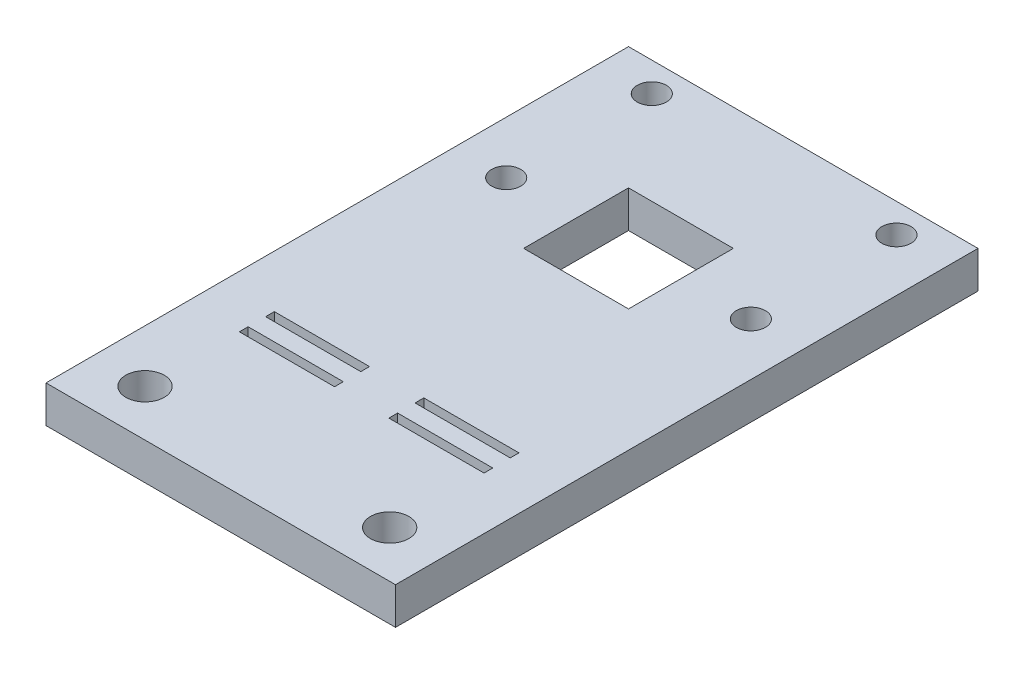
ISO-10303-21;
HEADER;
FILE_DESCRIPTION(('STEP AP214'),'2;1');
FILE_NAME('part.step','',(''),(''),'','','');
FILE_SCHEMA(('AUTOMOTIVE_DESIGN { 1 0 10303 214 1 1 1 1 }'));
ENDSEC;
DATA;
#1=APPLICATION_CONTEXT('core data for automotive mechanical design processes');
#2=APPLICATION_PROTOCOL_DEFINITION('international standard','automotive_design',2000,#1);
#3=PRODUCT_CONTEXT('',#1,'mechanical');
#4=PRODUCT('Part','Part','',(#3));
#5=PRODUCT_RELATED_PRODUCT_CATEGORY('part','',(#4));
#6=PRODUCT_DEFINITION_FORMATION('','',#4);
#7=PRODUCT_DEFINITION_CONTEXT('part definition',#1,'design');
#8=PRODUCT_DEFINITION('design','',#6,#7);
#9=PRODUCT_DEFINITION_SHAPE('','',#8);
#10=(LENGTH_UNIT() NAMED_UNIT(*) SI_UNIT(.MILLI.,.METRE.));
#11=(NAMED_UNIT(*) PLANE_ANGLE_UNIT() SI_UNIT($,.RADIAN.));
#12=(NAMED_UNIT(*) SI_UNIT($,.STERADIAN.) SOLID_ANGLE_UNIT());
#13=UNCERTAINTY_MEASURE_WITH_UNIT(LENGTH_MEASURE(1.E-05),#10,'distance_accuracy_value','');
#14=(GEOMETRIC_REPRESENTATION_CONTEXT(3) GLOBAL_UNCERTAINTY_ASSIGNED_CONTEXT((#13)) GLOBAL_UNIT_ASSIGNED_CONTEXT((#10,
#11,#12)) REPRESENTATION_CONTEXT('',''));
#15=CARTESIAN_POINT('',(0.,0.,0.));
#16=DIRECTION('',(0.,0.,1.));
#17=DIRECTION('',(1.,0.,0.));
#18=AXIS2_PLACEMENT_3D('',#15,#16,#17);
#19=CARTESIAN_POINT('',(10.5,3.175,0.));
#20=DIRECTION('',(-1.,0.,0.));
#21=DIRECTION('',(0.,0.,1.));
#22=AXIS2_PLACEMENT_3D('',#19,#20,#21);
#23=PLANE('',#22);
#24=DIRECTION('',(0.,0.,-1.));
#25=VECTOR('',#24,1.);
#26=CARTESIAN_POINT('',(10.5,0.,0.));
#27=LINE('',#26,#25);
#28=CARTESIAN_POINT('',(10.5,0.,12.9005122492005));
#29=VERTEX_POINT('',#28);
#30=CARTESIAN_POINT('',(10.5,0.,12.1505122492005));
#31=VERTEX_POINT('',#30);
#32=EDGE_CURVE('E359',#29,#31,#27,.T.);
#33=ORIENTED_EDGE('',*,*,#32,.F.);
#34=DIRECTION('',(0.,-1.,0.));
#35=VECTOR('',#34,1.);
#36=CARTESIAN_POINT('',(10.5,3.175,12.9005122492005));
#37=LINE('',#36,#35);
#38=CARTESIAN_POINT('',(10.5,3.175,12.9005122492005));
#39=VERTEX_POINT('',#38);
#40=EDGE_CURVE('E11',#39,#29,#37,.T.);
#41=ORIENTED_EDGE('',*,*,#40,.F.);
#42=DIRECTION('',(0.,0.,-1.));
#43=VECTOR('',#42,1.);
#44=CARTESIAN_POINT('',(10.5,3.175,0.));
#45=LINE('',#44,#43);
#46=CARTESIAN_POINT('',(10.5,3.175,12.1505122492005));
#47=VERTEX_POINT('',#46);
#48=EDGE_CURVE('E215',#39,#47,#45,.T.);
#49=ORIENTED_EDGE('',*,*,#48,.T.);
#50=DIRECTION('',(0.,-1.,0.));
#51=VECTOR('',#50,1.);
#52=CARTESIAN_POINT('',(10.5,3.175,12.1505122492005));
#53=LINE('',#52,#51);
#54=EDGE_CURVE('E53',#47,#31,#53,.T.);
#55=ORIENTED_EDGE('',*,*,#54,.T.);
#56=EDGE_LOOP('',(#33,#41,#49,#55));
#57=FACE_BOUND('',#56,.T.);
#58=ADVANCED_FACE('F34',(#57),#23,.T.);
#59=CARTESIAN_POINT('',(0.,3.175,12.9005122492005));
#60=DIRECTION('',(0.,0.,1.));
#61=DIRECTION('',(1.,0.,0.));
#62=AXIS2_PLACEMENT_3D('',#59,#60,#61);
#63=PLANE('',#62);
#64=DIRECTION('',(-1.,0.,0.));
#65=VECTOR('',#64,1.);
#66=CARTESIAN_POINT('',(0.,0.,12.9005122492005));
#67=LINE('',#66,#65);
#68=CARTESIAN_POINT('',(2.3300271835742,0.,12.9005122492005));
#69=VERTEX_POINT('',#68);
#70=EDGE_CURVE('E220',#29,#69,#67,.T.);
#71=ORIENTED_EDGE('',*,*,#70,.T.);
#72=DIRECTION('',(0.,-1.,0.));
#73=VECTOR('',#72,1.);
#74=CARTESIAN_POINT('',(2.3300271835742,3.175,12.9005122492005));
#75=LINE('',#74,#73);
#76=CARTESIAN_POINT('',(2.3300271835742,3.175,12.9005122492005));
#77=VERTEX_POINT('',#76);
#78=EDGE_CURVE('E44',#77,#69,#75,.T.);
#79=ORIENTED_EDGE('',*,*,#78,.F.);
#80=DIRECTION('',(-1.,0.,0.));
#81=VECTOR('',#80,1.);
#82=CARTESIAN_POINT('',(0.,3.175,12.9005122492005));
#83=LINE('',#82,#81);
#84=EDGE_CURVE('E210',#39,#77,#83,.T.);
#85=ORIENTED_EDGE('',*,*,#84,.F.);
#86=ORIENTED_EDGE('',*,*,#40,.T.);
#87=EDGE_LOOP('',(#71,#79,#85,#86));
#88=FACE_BOUND('',#87,.T.);
#89=ADVANCED_FACE('F218',(#88),#63,.F.);
#90=CARTESIAN_POINT('',(2.3300271835742,3.175,0.));
#91=DIRECTION('',(-1.,0.,0.));
#92=DIRECTION('',(0.,0.,1.));
#93=AXIS2_PLACEMENT_3D('',#90,#91,#92);
#94=PLANE('',#93);
#95=DIRECTION('',(0.,0.,-1.));
#96=VECTOR('',#95,1.);
#97=CARTESIAN_POINT('',(2.3300271835742,0.,0.));
#98=LINE('',#97,#96);
#99=CARTESIAN_POINT('',(2.3300271835742,0.,12.1505122492005));
#100=VERTEX_POINT('',#99);
#101=EDGE_CURVE('E362',#69,#100,#98,.T.);
#102=ORIENTED_EDGE('',*,*,#101,.T.);
#103=DIRECTION('',(0.,-1.,0.));
#104=VECTOR('',#103,1.);
#105=CARTESIAN_POINT('',(2.3300271835742,3.175,12.1505122492005));
#106=LINE('',#105,#104);
#107=CARTESIAN_POINT('',(2.3300271835742,3.175,12.1505122492005));
#108=VERTEX_POINT('',#107);
#109=EDGE_CURVE('E127',#108,#100,#106,.T.);
#110=ORIENTED_EDGE('',*,*,#109,.F.);
#111=DIRECTION('',(0.,0.,-1.));
#112=VECTOR('',#111,1.);
#113=CARTESIAN_POINT('',(2.3300271835742,3.175,0.));
#114=LINE('',#113,#112);
#115=EDGE_CURVE('E202',#77,#108,#114,.T.);
#116=ORIENTED_EDGE('',*,*,#115,.F.);
#117=ORIENTED_EDGE('',*,*,#78,.T.);
#118=EDGE_LOOP('',(#102,#110,#116,#117));
#119=FACE_BOUND('',#118,.T.);
#120=ADVANCED_FACE('F204',(#119),#94,.F.);
#121=CARTESIAN_POINT('',(10.5,3.175,0.));
#122=DIRECTION('',(-1.,0.,0.));
#123=DIRECTION('',(0.,0.,1.));
#124=AXIS2_PLACEMENT_3D('',#121,#122,#123);
#125=PLANE('',#124);
#126=DIRECTION('',(0.,0.,-1.));
#127=VECTOR('',#126,1.);
#128=CARTESIAN_POINT('',(10.5,0.,0.));
#129=LINE('',#128,#127);
#130=CARTESIAN_POINT('',(10.5,0.,10.6505122492005));
#131=VERTEX_POINT('',#130);
#132=CARTESIAN_POINT('',(10.5,0.,9.90051224920047));
#133=VERTEX_POINT('',#132);
#134=EDGE_CURVE('E347',#131,#133,#129,.T.);
#135=ORIENTED_EDGE('',*,*,#134,.F.);
#136=DIRECTION('',(0.,-1.,0.));
#137=VECTOR('',#136,1.);
#138=CARTESIAN_POINT('',(10.5,3.175,10.6505122492005));
#139=LINE('',#138,#137);
#140=CARTESIAN_POINT('',(10.5,3.175,10.6505122492005));
#141=VERTEX_POINT('',#140);
#142=EDGE_CURVE('E233',#141,#131,#139,.T.);
#143=ORIENTED_EDGE('',*,*,#142,.F.);
#144=DIRECTION('',(0.,0.,-1.));
#145=VECTOR('',#144,1.);
#146=CARTESIAN_POINT('',(10.5,3.175,0.));
#147=LINE('',#146,#145);
#148=CARTESIAN_POINT('',(10.5,3.175,9.90051224920047));
#149=VERTEX_POINT('',#148);
#150=EDGE_CURVE('E426',#141,#149,#147,.T.);
#151=ORIENTED_EDGE('',*,*,#150,.T.);
#152=DIRECTION('',(0.,-1.,0.));
#153=VECTOR('',#152,1.);
#154=CARTESIAN_POINT('',(10.5,3.175,9.90051224920047));
#155=LINE('',#154,#153);
#156=EDGE_CURVE('E225',#149,#133,#155,.T.);
#157=ORIENTED_EDGE('',*,*,#156,.T.);
#158=EDGE_LOOP('',(#135,#143,#151,#157));
#159=FACE_BOUND('',#158,.T.);
#160=ADVANCED_FACE('F473',(#159),#125,.T.);
#161=CARTESIAN_POINT('',(0.,3.175,10.6505122492005));
#162=DIRECTION('',(0.,0.,1.));
#163=DIRECTION('',(1.,0.,0.));
#164=AXIS2_PLACEMENT_3D('',#161,#162,#163);
#165=PLANE('',#164);
#166=DIRECTION('',(-1.,0.,0.));
#167=VECTOR('',#166,1.);
#168=CARTESIAN_POINT('',(0.,0.,10.6505122492005));
#169=LINE('',#168,#167);
#170=CARTESIAN_POINT('',(2.3300271835742,0.,10.6505122492005));
#171=VERTEX_POINT('',#170);
#172=EDGE_CURVE('E350',#131,#171,#169,.T.);
#173=ORIENTED_EDGE('',*,*,#172,.T.);
#174=DIRECTION('',(0.,-1.,0.));
#175=VECTOR('',#174,1.);
#176=CARTESIAN_POINT('',(2.3300271835742,3.175,10.6505122492005));
#177=LINE('',#176,#175);
#178=CARTESIAN_POINT('',(2.3300271835742,3.175,10.6505122492005));
#179=VERTEX_POINT('',#178);
#180=EDGE_CURVE('E230',#179,#171,#177,.T.);
#181=ORIENTED_EDGE('',*,*,#180,.F.);
#182=DIRECTION('',(-1.,0.,0.));
#183=VECTOR('',#182,1.);
#184=CARTESIAN_POINT('',(0.,3.175,10.6505122492005));
#185=LINE('',#184,#183);
#186=EDGE_CURVE('E429',#141,#179,#185,.T.);
#187=ORIENTED_EDGE('',*,*,#186,.F.);
#188=ORIENTED_EDGE('',*,*,#142,.T.);
#189=EDGE_LOOP('',(#173,#181,#187,#188));
#190=FACE_BOUND('',#189,.T.);
#191=ADVANCED_FACE('F469',(#190),#165,.F.);
#192=CARTESIAN_POINT('',(2.33002718357419,3.175,0.));
#193=DIRECTION('',(-1.,0.,0.));
#194=DIRECTION('',(0.,0.,1.));
#195=AXIS2_PLACEMENT_3D('',#192,#193,#194);
#196=PLANE('',#195);
#197=DIRECTION('',(0.,0.,-1.));
#198=VECTOR('',#197,1.);
#199=CARTESIAN_POINT('',(2.33002718357419,0.,0.));
#200=LINE('',#199,#198);
#201=CARTESIAN_POINT('',(2.3300271835742,0.,9.90051224920048));
#202=VERTEX_POINT('',#201);
#203=EDGE_CURVE('E353',#171,#202,#200,.T.);
#204=ORIENTED_EDGE('',*,*,#203,.T.);
#205=DIRECTION('',(0.,-1.,0.));
#206=VECTOR('',#205,1.);
#207=CARTESIAN_POINT('',(2.3300271835742,3.175,9.90051224920048));
#208=LINE('',#207,#206);
#209=CARTESIAN_POINT('',(2.3300271835742,3.175,9.90051224920048));
#210=VERTEX_POINT('',#209);
#211=EDGE_CURVE('E227',#210,#202,#208,.T.);
#212=ORIENTED_EDGE('',*,*,#211,.F.);
#213=DIRECTION('',(0.,0.,-1.));
#214=VECTOR('',#213,1.);
#215=CARTESIAN_POINT('',(2.33002718357419,3.175,0.));
#216=LINE('',#215,#214);
#217=EDGE_CURVE('E432',#179,#210,#216,.T.);
#218=ORIENTED_EDGE('',*,*,#217,.F.);
#219=ORIENTED_EDGE('',*,*,#180,.T.);
#220=EDGE_LOOP('',(#204,#212,#218,#219));
#221=FACE_BOUND('',#220,.T.);
#222=ADVANCED_FACE('F465',(#221),#196,.F.);
#223=CARTESIAN_POINT('',(15.0000000000001,3.175,0.));
#224=DIRECTION('',(1.,0.,0.));
#225=DIRECTION('',(0.,0.,-1.));
#226=AXIS2_PLACEMENT_3D('',#223,#224,#225);
#227=PLANE('',#226);
#228=DIRECTION('',(0.,0.,1.));
#229=VECTOR('',#228,1.);
#230=CARTESIAN_POINT('',(15.0000000000001,0.,0.));
#231=LINE('',#230,#229);
#232=CARTESIAN_POINT('',(15.0000000000001,0.,-25.));
#233=VERTEX_POINT('',#232);
#234=CARTESIAN_POINT('',(15.0000000000001,0.,25.));
#235=VERTEX_POINT('',#234);
#236=EDGE_CURVE('E335',#233,#235,#231,.T.);
#237=ORIENTED_EDGE('',*,*,#236,.F.);
#238=DIRECTION('',(0.,-1.,0.));
#239=VECTOR('',#238,1.);
#240=CARTESIAN_POINT('',(15.0000000000001,3.175,-25.));
#241=LINE('',#240,#239);
#242=CARTESIAN_POINT('',(15.0000000000001,3.175,-25.));
#243=VERTEX_POINT('',#242);
#244=EDGE_CURVE('E228',#243,#233,#241,.T.);
#245=ORIENTED_EDGE('',*,*,#244,.F.);
#246=DIRECTION('',(0.,0.,1.));
#247=VECTOR('',#246,1.);
#248=CARTESIAN_POINT('',(15.0000000000001,3.175,0.));
#249=LINE('',#248,#247);
#250=CARTESIAN_POINT('',(15.0000000000001,3.175,25.));
#251=VERTEX_POINT('',#250);
#252=EDGE_CURVE('E415',#243,#251,#249,.T.);
#253=ORIENTED_EDGE('',*,*,#252,.T.);
#254=DIRECTION('',(0.,-1.,0.));
#255=VECTOR('',#254,1.);
#256=CARTESIAN_POINT('',(15.0000000000001,3.175,25.));
#257=LINE('',#256,#255);
#258=EDGE_CURVE('E235',#251,#235,#257,.T.);
#259=ORIENTED_EDGE('',*,*,#258,.T.);
#260=EDGE_LOOP('',(#237,#245,#253,#259));
#261=FACE_BOUND('',#260,.T.);
#262=ADVANCED_FACE('F468',(#261),#227,.T.);
#263=CARTESIAN_POINT('',(0.,3.175,-25.));
#264=DIRECTION('',(0.,0.,-1.));
#265=DIRECTION('',(-1.,0.,0.));
#266=AXIS2_PLACEMENT_3D('',#263,#264,#265);
#267=PLANE('',#266);
#268=DIRECTION('',(1.,0.,0.));
#269=VECTOR('',#268,1.);
#270=CARTESIAN_POINT('',(0.,0.,-25.));
#271=LINE('',#270,#269);
#272=CARTESIAN_POINT('',(-15.0000000000001,0.,-25.));
#273=VERTEX_POINT('',#272);
#274=EDGE_CURVE('E338',#273,#233,#271,.T.);
#275=ORIENTED_EDGE('',*,*,#274,.F.);
#276=DIRECTION('',(0.,-1.,0.));
#277=VECTOR('',#276,1.);
#278=CARTESIAN_POINT('',(-15.0000000000001,3.175,-25.));
#279=LINE('',#278,#277);
#280=CARTESIAN_POINT('',(-15.0000000000001,3.175,-25.));
#281=VERTEX_POINT('',#280);
#282=EDGE_CURVE('E241',#281,#273,#279,.T.);
#283=ORIENTED_EDGE('',*,*,#282,.F.);
#284=DIRECTION('',(1.,0.,0.));
#285=VECTOR('',#284,1.);
#286=CARTESIAN_POINT('',(0.,3.175,-25.));
#287=LINE('',#286,#285);
#288=EDGE_CURVE('E418',#281,#243,#287,.T.);
#289=ORIENTED_EDGE('',*,*,#288,.T.);
#290=ORIENTED_EDGE('',*,*,#244,.T.);
#291=EDGE_LOOP('',(#275,#283,#289,#290));
#292=FACE_BOUND('',#291,.T.);
#293=ADVANCED_FACE('F486',(#292),#267,.T.);
#294=CARTESIAN_POINT('',(-15.0000000000001,3.175,0.));
#295=DIRECTION('',(1.,0.,0.));
#296=DIRECTION('',(0.,0.,-1.));
#297=AXIS2_PLACEMENT_3D('',#294,#295,#296);
#298=PLANE('',#297);
#299=DIRECTION('',(0.,0.,1.));
#300=VECTOR('',#299,1.);
#301=CARTESIAN_POINT('',(-15.0000000000001,0.,0.));
#302=LINE('',#301,#300);
#303=CARTESIAN_POINT('',(-15.0000000000001,0.,25.));
#304=VERTEX_POINT('',#303);
#305=EDGE_CURVE('E341',#273,#304,#302,.T.);
#306=ORIENTED_EDGE('',*,*,#305,.T.);
#307=DIRECTION('',(0.,-1.,0.));
#308=VECTOR('',#307,1.);
#309=CARTESIAN_POINT('',(-15.0000000000001,3.175,25.));
#310=LINE('',#309,#308);
#311=CARTESIAN_POINT('',(-15.0000000000001,3.175,25.));
#312=VERTEX_POINT('',#311);
#313=EDGE_CURVE('E237',#312,#304,#310,.T.);
#314=ORIENTED_EDGE('',*,*,#313,.F.);
#315=DIRECTION('',(0.,0.,1.));
#316=VECTOR('',#315,1.);
#317=CARTESIAN_POINT('',(-15.0000000000001,3.175,0.));
#318=LINE('',#317,#316);
#319=EDGE_CURVE('E421',#281,#312,#318,.T.);
#320=ORIENTED_EDGE('',*,*,#319,.F.);
#321=ORIENTED_EDGE('',*,*,#282,.T.);
#322=EDGE_LOOP('',(#306,#314,#320,#321));
#323=FACE_BOUND('',#322,.T.);
#324=ADVANCED_FACE('F482',(#323),#298,.F.);
#325=CARTESIAN_POINT('',(-2.33002718357419,3.175,0.));
#326=DIRECTION('',(-1.,0.,0.));
#327=DIRECTION('',(0.,0.,1.));
#328=AXIS2_PLACEMENT_3D('',#325,#326,#327);
#329=PLANE('',#328);
#330=DIRECTION('',(0.,0.,-1.));
#331=VECTOR('',#330,1.);
#332=CARTESIAN_POINT('',(-2.33002718357419,0.,0.));
#333=LINE('',#332,#331);
#334=CARTESIAN_POINT('',(-2.33002718357419,0.,12.9005122492005));
#335=VERTEX_POINT('',#334);
#336=CARTESIAN_POINT('',(-2.33002718357419,0.,12.1505122492005));
#337=VERTEX_POINT('',#336);
#338=EDGE_CURVE('E323',#335,#337,#333,.T.);
#339=ORIENTED_EDGE('',*,*,#338,.F.);
#340=DIRECTION('',(0.,-1.,0.));
#341=VECTOR('',#340,1.);
#342=CARTESIAN_POINT('',(-2.33002718357419,3.175,12.9005122492005));
#343=LINE('',#342,#341);
#344=CARTESIAN_POINT('',(-2.33002718357419,3.175,12.9005122492005));
#345=VERTEX_POINT('',#344);
#346=EDGE_CURVE('E238',#345,#335,#343,.T.);
#347=ORIENTED_EDGE('',*,*,#346,.F.);
#348=DIRECTION('',(0.,0.,-1.));
#349=VECTOR('',#348,1.);
#350=CARTESIAN_POINT('',(-2.33002718357419,3.175,0.));
#351=LINE('',#350,#349);
#352=CARTESIAN_POINT('',(-2.33002718357419,3.175,12.1505122492005));
#353=VERTEX_POINT('',#352);
#354=EDGE_CURVE('E404',#345,#353,#351,.T.);
#355=ORIENTED_EDGE('',*,*,#354,.T.);
#356=DIRECTION('',(0.,-1.,0.));
#357=VECTOR('',#356,1.);
#358=CARTESIAN_POINT('',(-2.33002718357419,3.175,12.1505122492005));
#359=LINE('',#358,#357);
#360=EDGE_CURVE('E244',#353,#337,#359,.T.);
#361=ORIENTED_EDGE('',*,*,#360,.T.);
#362=EDGE_LOOP('',(#339,#347,#355,#361));
#363=FACE_BOUND('',#362,.T.);
#364=ADVANCED_FACE('F485',(#363),#329,.T.);
#365=CARTESIAN_POINT('',(0.,3.175,12.9005122492005));
#366=DIRECTION('',(0.,0.,-1.));
#367=DIRECTION('',(-1.,0.,0.));
#368=AXIS2_PLACEMENT_3D('',#365,#366,#367);
#369=PLANE('',#368);
#370=DIRECTION('',(1.,0.,0.));
#371=VECTOR('',#370,1.);
#372=CARTESIAN_POINT('',(0.,0.,12.9005122492005));
#373=LINE('',#372,#371);
#374=CARTESIAN_POINT('',(-10.5,0.,12.9005122492005));
#375=VERTEX_POINT('',#374);
#376=EDGE_CURVE('E326',#375,#335,#373,.T.);
#377=ORIENTED_EDGE('',*,*,#376,.F.);
#378=DIRECTION('',(0.,-1.,0.));
#379=VECTOR('',#378,1.);
#380=CARTESIAN_POINT('',(-10.5,3.175,12.9005122492005));
#381=LINE('',#380,#379);
#382=CARTESIAN_POINT('',(-10.5,3.175,12.9005122492005));
#383=VERTEX_POINT('',#382);
#384=EDGE_CURVE('E250',#383,#375,#381,.T.);
#385=ORIENTED_EDGE('',*,*,#384,.F.);
#386=DIRECTION('',(1.,0.,0.));
#387=VECTOR('',#386,1.);
#388=CARTESIAN_POINT('',(0.,3.175,12.9005122492005));
#389=LINE('',#388,#387);
#390=EDGE_CURVE('E407',#383,#345,#389,.T.);
#391=ORIENTED_EDGE('',*,*,#390,.T.);
#392=ORIENTED_EDGE('',*,*,#346,.T.);
#393=EDGE_LOOP('',(#377,#385,#391,#392));
#394=FACE_BOUND('',#393,.T.);
#395=ADVANCED_FACE('F502',(#394),#369,.T.);
#396=CARTESIAN_POINT('',(-10.5,3.175,0.));
#397=DIRECTION('',(-1.,0.,0.));
#398=DIRECTION('',(0.,0.,1.));
#399=AXIS2_PLACEMENT_3D('',#396,#397,#398);
#400=PLANE('',#399);
#401=DIRECTION('',(0.,0.,-1.));
#402=VECTOR('',#401,1.);
#403=CARTESIAN_POINT('',(-10.5,0.,0.));
#404=LINE('',#403,#402);
#405=CARTESIAN_POINT('',(-10.5,0.,12.1505122492005));
#406=VERTEX_POINT('',#405);
#407=EDGE_CURVE('E329',#375,#406,#404,.T.);
#408=ORIENTED_EDGE('',*,*,#407,.T.);
#409=DIRECTION('',(0.,-1.,0.));
#410=VECTOR('',#409,1.);
#411=CARTESIAN_POINT('',(-10.5,3.175,12.1505122492005));
#412=LINE('',#411,#410);
#413=CARTESIAN_POINT('',(-10.5,3.175,12.1505122492005));
#414=VERTEX_POINT('',#413);
#415=EDGE_CURVE('E246',#414,#406,#412,.T.);
#416=ORIENTED_EDGE('',*,*,#415,.F.);
#417=DIRECTION('',(0.,0.,-1.));
#418=VECTOR('',#417,1.);
#419=CARTESIAN_POINT('',(-10.5,3.175,0.));
#420=LINE('',#419,#418);
#421=EDGE_CURVE('E410',#383,#414,#420,.T.);
#422=ORIENTED_EDGE('',*,*,#421,.F.);
#423=ORIENTED_EDGE('',*,*,#384,.T.);
#424=EDGE_LOOP('',(#408,#416,#422,#423));
#425=FACE_BOUND('',#424,.T.);
#426=ADVANCED_FACE('F498',(#425),#400,.F.);
#427=CARTESIAN_POINT('',(-2.33002718357419,3.175,0.));
#428=DIRECTION('',(-1.,0.,0.));
#429=DIRECTION('',(0.,0.,1.));
#430=AXIS2_PLACEMENT_3D('',#427,#428,#429);
#431=PLANE('',#430);
#432=DIRECTION('',(0.,0.,-1.));
#433=VECTOR('',#432,1.);
#434=CARTESIAN_POINT('',(-2.33002718357419,0.,0.));
#435=LINE('',#434,#433);
#436=CARTESIAN_POINT('',(-2.33002718357419,0.,10.6505122492005));
#437=VERTEX_POINT('',#436);
#438=CARTESIAN_POINT('',(-2.33002718357419,0.,9.90051224920048));
#439=VERTEX_POINT('',#438);
#440=EDGE_CURVE('E311',#437,#439,#435,.T.);
#441=ORIENTED_EDGE('',*,*,#440,.F.);
#442=DIRECTION('',(0.,-1.,0.));
#443=VECTOR('',#442,1.);
#444=CARTESIAN_POINT('',(-2.33002718357419,3.175,10.6505122492005));
#445=LINE('',#444,#443);
#446=CARTESIAN_POINT('',(-2.33002718357419,3.175,10.6505122492005));
#447=VERTEX_POINT('',#446);
#448=EDGE_CURVE('E247',#447,#437,#445,.T.);
#449=ORIENTED_EDGE('',*,*,#448,.F.);
#450=DIRECTION('',(0.,0.,-1.));
#451=VECTOR('',#450,1.);
#452=CARTESIAN_POINT('',(-2.33002718357419,3.175,0.));
#453=LINE('',#452,#451);
#454=CARTESIAN_POINT('',(-2.33002718357419,3.175,9.90051224920048));
#455=VERTEX_POINT('',#454);
#456=EDGE_CURVE('E393',#447,#455,#453,.T.);
#457=ORIENTED_EDGE('',*,*,#456,.T.);
#458=DIRECTION('',(0.,-1.,0.));
#459=VECTOR('',#458,1.);
#460=CARTESIAN_POINT('',(-2.33002718357419,3.175,9.90051224920048));
#461=LINE('',#460,#459);
#462=EDGE_CURVE('E253',#455,#439,#461,.T.);
#463=ORIENTED_EDGE('',*,*,#462,.T.);
#464=EDGE_LOOP('',(#441,#449,#457,#463));
#465=FACE_BOUND('',#464,.T.);
#466=ADVANCED_FACE('F501',(#465),#431,.T.);
#467=CARTESIAN_POINT('',(0.,3.175,10.6505122492005));
#468=DIRECTION('',(0.,0.,-1.));
#469=DIRECTION('',(-1.,0.,0.));
#470=AXIS2_PLACEMENT_3D('',#467,#468,#469);
#471=PLANE('',#470);
#472=DIRECTION('',(1.,0.,0.));
#473=VECTOR('',#472,1.);
#474=CARTESIAN_POINT('',(0.,0.,10.6505122492005));
#475=LINE('',#474,#473);
#476=CARTESIAN_POINT('',(-10.5,0.,10.6505122492005));
#477=VERTEX_POINT('',#476);
#478=EDGE_CURVE('E314',#477,#437,#475,.T.);
#479=ORIENTED_EDGE('',*,*,#478,.F.);
#480=DIRECTION('',(0.,-1.,0.));
#481=VECTOR('',#480,1.);
#482=CARTESIAN_POINT('',(-10.5,3.175,10.6505122492005));
#483=LINE('',#482,#481);
#484=CARTESIAN_POINT('',(-10.5,3.175,10.6505122492005));
#485=VERTEX_POINT('',#484);
#486=EDGE_CURVE('E258',#485,#477,#483,.T.);
#487=ORIENTED_EDGE('',*,*,#486,.F.);
#488=DIRECTION('',(1.,0.,0.));
#489=VECTOR('',#488,1.);
#490=CARTESIAN_POINT('',(0.,3.175,10.6505122492005));
#491=LINE('',#490,#489);
#492=EDGE_CURVE('E396',#485,#447,#491,.T.);
#493=ORIENTED_EDGE('',*,*,#492,.T.);
#494=ORIENTED_EDGE('',*,*,#448,.T.);
#495=EDGE_LOOP('',(#479,#487,#493,#494));
#496=FACE_BOUND('',#495,.T.);
#497=ADVANCED_FACE('F517',(#496),#471,.T.);
#498=CARTESIAN_POINT('',(-10.5,3.175,0.));
#499=DIRECTION('',(-1.,0.,0.));
#500=DIRECTION('',(0.,0.,1.));
#501=AXIS2_PLACEMENT_3D('',#498,#499,#500);
#502=PLANE('',#501);
#503=DIRECTION('',(0.,0.,-1.));
#504=VECTOR('',#503,1.);
#505=CARTESIAN_POINT('',(-10.5,0.,0.));
#506=LINE('',#505,#504);
#507=CARTESIAN_POINT('',(-10.5,0.,9.90051224920048));
#508=VERTEX_POINT('',#507);
#509=EDGE_CURVE('E317',#477,#508,#506,.T.);
#510=ORIENTED_EDGE('',*,*,#509,.T.);
#511=DIRECTION('',(0.,-1.,0.));
#512=VECTOR('',#511,1.);
#513=CARTESIAN_POINT('',(-10.5,3.175,9.90051224920048));
#514=LINE('',#513,#512);
#515=CARTESIAN_POINT('',(-10.5,3.175,9.90051224920048));
#516=VERTEX_POINT('',#515);
#517=EDGE_CURVE('E255',#516,#508,#514,.T.);
#518=ORIENTED_EDGE('',*,*,#517,.F.);
#519=DIRECTION('',(0.,0.,-1.));
#520=VECTOR('',#519,1.);
#521=CARTESIAN_POINT('',(-10.5,3.175,0.));
#522=LINE('',#521,#520);
#523=EDGE_CURVE('E399',#485,#516,#522,.T.);
#524=ORIENTED_EDGE('',*,*,#523,.F.);
#525=ORIENTED_EDGE('',*,*,#486,.T.);
#526=EDGE_LOOP('',(#510,#518,#524,#525));
#527=FACE_BOUND('',#526,.T.);
#528=ADVANCED_FACE('F514',(#527),#502,.F.);
#529=CARTESIAN_POINT('',(0.,3.175,-5.50000000000001));
#530=DIRECTION('',(0.,0.,-1.));
#531=DIRECTION('',(-1.,0.,0.));
#532=AXIS2_PLACEMENT_3D('',#529,#530,#531);
#533=PLANE('',#532);
#534=DIRECTION('',(1.,0.,0.));
#535=VECTOR('',#534,1.);
#536=CARTESIAN_POINT('',(0.,0.,-5.50000000000001));
#537=LINE('',#536,#535);
#538=CARTESIAN_POINT('',(-4.49999999999998,0.,-5.50000000000001));
#539=VERTEX_POINT('',#538);
#540=CARTESIAN_POINT('',(4.50000000000002,0.,-5.50000000000001));
#541=VERTEX_POINT('',#540);
#542=EDGE_CURVE('E278',#539,#541,#537,.T.);
#543=ORIENTED_EDGE('',*,*,#542,.F.);
#544=DIRECTION('',(0.,-1.,0.));
#545=VECTOR('',#544,1.);
#546=CARTESIAN_POINT('',(-4.49999999999998,3.175,-5.50000000000001));
#547=LINE('',#546,#545);
#548=CARTESIAN_POINT('',(-4.49999999999998,3.175,-5.50000000000001));
#549=VERTEX_POINT('',#548);
#550=EDGE_CURVE('E38',#549,#539,#547,.T.);
#551=ORIENTED_EDGE('',*,*,#550,.F.);
#552=DIRECTION('',(1.,0.,0.));
#553=VECTOR('',#552,1.);
#554=CARTESIAN_POINT('',(0.,3.175,-5.50000000000001));
#555=LINE('',#554,#553);
#556=CARTESIAN_POINT('',(4.50000000000002,3.175,-5.50000000000001));
#557=VERTEX_POINT('',#556);
#558=EDGE_CURVE('E366',#549,#557,#555,.T.);
#559=ORIENTED_EDGE('',*,*,#558,.T.);
#560=DIRECTION('',(0.,-1.,0.));
#561=VECTOR('',#560,1.);
#562=CARTESIAN_POINT('',(4.50000000000002,3.175,-5.50000000000001));
#563=LINE('',#562,#561);
#564=EDGE_CURVE('E261',#557,#541,#563,.T.);
#565=ORIENTED_EDGE('',*,*,#564,.T.);
#566=EDGE_LOOP('',(#543,#551,#559,#565));
#567=FACE_BOUND('',#566,.T.);
#568=ADVANCED_FACE('F36',(#567),#533,.T.);
#569=CARTESIAN_POINT('',(-4.49999999999998,3.175,0.));
#570=DIRECTION('',(1.,0.,0.));
#571=DIRECTION('',(0.,0.,-1.));
#572=AXIS2_PLACEMENT_3D('',#569,#570,#571);
#573=PLANE('',#572);
#574=DIRECTION('',(0.,0.,1.));
#575=VECTOR('',#574,1.);
#576=CARTESIAN_POINT('',(-4.49999999999998,0.,0.));
#577=LINE('',#576,#575);
#578=CARTESIAN_POINT('',(-4.49999999999998,0.,-14.5));
#579=VERTEX_POINT('',#578);
#580=EDGE_CURVE('E274',#579,#539,#577,.T.);
#581=ORIENTED_EDGE('',*,*,#580,.F.);
#582=DIRECTION('',(0.,-1.,0.));
#583=VECTOR('',#582,1.);
#584=CARTESIAN_POINT('',(-4.49999999999998,3.175,-14.5));
#585=LINE('',#584,#583);
#586=CARTESIAN_POINT('',(-4.49999999999998,3.175,-14.5));
#587=VERTEX_POINT('',#586);
#588=EDGE_CURVE('E265',#587,#579,#585,.T.);
#589=ORIENTED_EDGE('',*,*,#588,.F.);
#590=DIRECTION('',(0.,0.,1.));
#591=VECTOR('',#590,1.);
#592=CARTESIAN_POINT('',(-4.49999999999998,3.175,0.));
#593=LINE('',#592,#591);
#594=EDGE_CURVE('E276',#587,#549,#593,.T.);
#595=ORIENTED_EDGE('',*,*,#594,.T.);
#596=ORIENTED_EDGE('',*,*,#550,.T.);
#597=EDGE_LOOP('',(#581,#589,#595,#596));
#598=FACE_BOUND('',#597,.T.);
#599=ADVANCED_FACE('F272',(#598),#573,.T.);
#600=CARTESIAN_POINT('',(0.,3.175,-14.5));
#601=DIRECTION('',(0.,0.,-1.));
#602=DIRECTION('',(-1.,0.,0.));
#603=AXIS2_PLACEMENT_3D('',#600,#601,#602);
#604=PLANE('',#603);
#605=DIRECTION('',(1.,0.,0.));
#606=VECTOR('',#605,1.);
#607=CARTESIAN_POINT('',(0.,0.,-14.5));
#608=LINE('',#607,#606);
#609=CARTESIAN_POINT('',(4.50000000000002,0.,-14.5));
#610=VERTEX_POINT('',#609);
#611=EDGE_CURVE('E286',#579,#610,#608,.T.);
#612=ORIENTED_EDGE('',*,*,#611,.T.);
#613=DIRECTION('',(0.,-1.,0.));
#614=VECTOR('',#613,1.);
#615=CARTESIAN_POINT('',(4.50000000000002,3.175,-14.5));
#616=LINE('',#615,#614);
#617=CARTESIAN_POINT('',(4.50000000000002,3.175,-14.5));
#618=VERTEX_POINT('',#617);
#619=EDGE_CURVE('E263',#618,#610,#616,.T.);
#620=ORIENTED_EDGE('',*,*,#619,.F.);
#621=DIRECTION('',(1.,0.,0.));
#622=VECTOR('',#621,1.);
#623=CARTESIAN_POINT('',(0.,3.175,-14.5));
#624=LINE('',#623,#622);
#625=EDGE_CURVE('E369',#587,#618,#624,.T.);
#626=ORIENTED_EDGE('',*,*,#625,.F.);
#627=ORIENTED_EDGE('',*,*,#588,.T.);
#628=EDGE_LOOP('',(#612,#620,#626,#627));
#629=FACE_BOUND('',#628,.T.);
#630=ADVANCED_FACE('F463',(#629),#604,.F.);
#631=CARTESIAN_POINT('',(0.,3.175,9.90051224920048));
#632=DIRECTION('',(0.,0.,1.));
#633=DIRECTION('',(1.,0.,0.));
#634=AXIS2_PLACEMENT_3D('',#631,#632,#633);
#635=PLANE('',#634);
#636=DIRECTION('',(-1.,0.,0.));
#637=VECTOR('',#636,1.);
#638=CARTESIAN_POINT('',(0.,0.,9.90051224920048));
#639=LINE('',#638,#637);
#640=EDGE_CURVE('E356',#133,#202,#639,.T.);
#641=ORIENTED_EDGE('',*,*,#640,.F.);
#642=ORIENTED_EDGE('',*,*,#156,.F.);
#643=DIRECTION('',(-1.,0.,0.));
#644=VECTOR('',#643,1.);
#645=CARTESIAN_POINT('',(0.,3.175,9.90051224920048));
#646=LINE('',#645,#644);
#647=EDGE_CURVE('E434',#149,#210,#646,.T.);
#648=ORIENTED_EDGE('',*,*,#647,.T.);
#649=ORIENTED_EDGE('',*,*,#211,.T.);
#650=EDGE_LOOP('',(#641,#642,#648,#649));
#651=FACE_BOUND('',#650,.T.);
#652=ADVANCED_FACE('F459',(#651),#635,.T.);
#653=CARTESIAN_POINT('',(0.,3.175,25.));
#654=DIRECTION('',(0.,0.,-1.));
#655=DIRECTION('',(-1.,0.,0.));
#656=AXIS2_PLACEMENT_3D('',#653,#654,#655);
#657=PLANE('',#656);
#658=DIRECTION('',(1.,0.,0.));
#659=VECTOR('',#658,1.);
#660=CARTESIAN_POINT('',(0.,0.,25.));
#661=LINE('',#660,#659);
#662=EDGE_CURVE('E344',#304,#235,#661,.T.);
#663=ORIENTED_EDGE('',*,*,#662,.T.);
#664=ORIENTED_EDGE('',*,*,#258,.F.);
#665=DIRECTION('',(1.,0.,0.));
#666=VECTOR('',#665,1.);
#667=CARTESIAN_POINT('',(0.,3.175,25.));
#668=LINE('',#667,#666);
#669=EDGE_CURVE('E424',#312,#251,#668,.T.);
#670=ORIENTED_EDGE('',*,*,#669,.F.);
#671=ORIENTED_EDGE('',*,*,#313,.T.);
#672=EDGE_LOOP('',(#663,#664,#670,#671));
#673=FACE_BOUND('',#672,.T.);
#674=ADVANCED_FACE('F462',(#673),#657,.F.);
#675=CARTESIAN_POINT('',(0.,3.175,12.1505122492005));
#676=DIRECTION('',(0.,0.,-1.));
#677=DIRECTION('',(-1.,0.,0.));
#678=AXIS2_PLACEMENT_3D('',#675,#676,#677);
#679=PLANE('',#678);
#680=DIRECTION('',(1.,0.,0.));
#681=VECTOR('',#680,1.);
#682=CARTESIAN_POINT('',(0.,0.,12.1505122492005));
#683=LINE('',#682,#681);
#684=EDGE_CURVE('E332',#406,#337,#683,.T.);
#685=ORIENTED_EDGE('',*,*,#684,.T.);
#686=ORIENTED_EDGE('',*,*,#360,.F.);
#687=DIRECTION('',(1.,0.,0.));
#688=VECTOR('',#687,1.);
#689=CARTESIAN_POINT('',(0.,3.175,12.1505122492005));
#690=LINE('',#689,#688);
#691=EDGE_CURVE('E413',#414,#353,#690,.T.);
#692=ORIENTED_EDGE('',*,*,#691,.F.);
#693=ORIENTED_EDGE('',*,*,#415,.T.);
#694=EDGE_LOOP('',(#685,#686,#692,#693));
#695=FACE_BOUND('',#694,.T.);
#696=ADVANCED_FACE('F480',(#695),#679,.F.);
#697=CARTESIAN_POINT('',(0.,3.175,9.90051224920048));
#698=DIRECTION('',(0.,0.,-1.));
#699=DIRECTION('',(-1.,0.,0.));
#700=AXIS2_PLACEMENT_3D('',#697,#698,#699);
#701=PLANE('',#700);
#702=DIRECTION('',(1.,0.,0.));
#703=VECTOR('',#702,1.);
#704=CARTESIAN_POINT('',(0.,0.,9.90051224920048));
#705=LINE('',#704,#703);
#706=EDGE_CURVE('E320',#508,#439,#705,.T.);
#707=ORIENTED_EDGE('',*,*,#706,.T.);
#708=ORIENTED_EDGE('',*,*,#462,.F.);
#709=DIRECTION('',(1.,0.,0.));
#710=VECTOR('',#709,1.);
#711=CARTESIAN_POINT('',(0.,3.175,9.90051224920048));
#712=LINE('',#711,#710);
#713=EDGE_CURVE('E402',#516,#455,#712,.T.);
#714=ORIENTED_EDGE('',*,*,#713,.F.);
#715=ORIENTED_EDGE('',*,*,#517,.T.);
#716=EDGE_LOOP('',(#707,#708,#714,#715));
#717=FACE_BOUND('',#716,.T.);
#718=ADVANCED_FACE('F496',(#717),#701,.F.);
#719=CARTESIAN_POINT('',(-10.5,3.175,-22.5));
#720=DIRECTION('',(0.,-1.,0.));
#721=DIRECTION('',(0.,0.,-1.));
#722=AXIS2_PLACEMENT_3D('',#719,#720,#721);
#723=CYLINDRICAL_SURFACE('',#722,1.25);
#724=CARTESIAN_POINT('',(-10.5,3.175,-22.5));
#725=DIRECTION('',(0.,1.,0.));
#726=DIRECTION('',(0.,0.,1.));
#727=AXIS2_PLACEMENT_3D('',#724,#725,#726);
#728=CIRCLE('',#727,1.25);
#729=CARTESIAN_POINT('',(-10.5,3.175,-21.25));
#730=VERTEX_POINT('',#729);
#731=EDGE_CURVE('E390',#730,#730,#728,.T.);
#732=ORIENTED_EDGE('',*,*,#731,.T.);
#733=EDGE_LOOP('',(#732));
#734=FACE_BOUND('',#733,.T.);
#735=CARTESIAN_POINT('',(-10.5,0.,-22.5));
#736=DIRECTION('',(0.,1.,0.));
#737=DIRECTION('',(0.,0.,1.));
#738=AXIS2_PLACEMENT_3D('',#735,#736,#737);
#739=CIRCLE('',#738,1.25);
#740=CARTESIAN_POINT('',(-10.5,0.,-21.25));
#741=VERTEX_POINT('',#740);
#742=EDGE_CURVE('E308',#741,#741,#739,.T.);
#743=ORIENTED_EDGE('',*,*,#742,.F.);
#744=EDGE_LOOP('',(#743));
#745=FACE_BOUND('',#744,.T.);
#746=ADVANCED_FACE('F512',(#734,#745),#723,.F.);
#747=CARTESIAN_POINT('',(10.5,3.175,-22.5));
#748=DIRECTION('',(0.,-1.,0.));
#749=DIRECTION('',(0.,0.,-1.));
#750=AXIS2_PLACEMENT_3D('',#747,#748,#749);
#751=CYLINDRICAL_SURFACE('',#750,1.25);
#752=CARTESIAN_POINT('',(10.5,3.175,-22.5));
#753=DIRECTION('',(0.,1.,0.));
#754=DIRECTION('',(0.,0.,1.));
#755=AXIS2_PLACEMENT_3D('',#752,#753,#754);
#756=CIRCLE('',#755,1.25);
#757=CARTESIAN_POINT('',(10.5,3.175,-21.25));
#758=VERTEX_POINT('',#757);
#759=EDGE_CURVE('E387',#758,#758,#756,.T.);
#760=ORIENTED_EDGE('',*,*,#759,.T.);
#761=EDGE_LOOP('',(#760));
#762=FACE_BOUND('',#761,.T.);
#763=CARTESIAN_POINT('',(10.5,0.,-22.5));
#764=DIRECTION('',(0.,1.,0.));
#765=DIRECTION('',(0.,0.,1.));
#766=AXIS2_PLACEMENT_3D('',#763,#764,#765);
#767=CIRCLE('',#766,1.25);
#768=CARTESIAN_POINT('',(10.5,0.,-21.25));
#769=VERTEX_POINT('',#768);
#770=EDGE_CURVE('E305',#769,#769,#767,.T.);
#771=ORIENTED_EDGE('',*,*,#770,.F.);
#772=EDGE_LOOP('',(#771));
#773=FACE_BOUND('',#772,.T.);
#774=ADVANCED_FACE('F527',(#762,#773),#751,.F.);
#775=CARTESIAN_POINT('',(10.5,3.175,-10.));
#776=DIRECTION('',(0.,-1.,0.));
#777=DIRECTION('',(0.,0.,-1.));
#778=AXIS2_PLACEMENT_3D('',#775,#776,#777);
#779=CYLINDRICAL_SURFACE('',#778,1.25);
#780=CARTESIAN_POINT('',(10.5,3.175,-10.));
#781=DIRECTION('',(0.,1.,0.));
#782=DIRECTION('',(0.,0.,1.));
#783=AXIS2_PLACEMENT_3D('',#780,#781,#782);
#784=CIRCLE('',#783,1.25);
#785=CARTESIAN_POINT('',(10.5,3.175,-8.75000000000001));
#786=VERTEX_POINT('',#785);
#787=EDGE_CURVE('E384',#786,#786,#784,.T.);
#788=ORIENTED_EDGE('',*,*,#787,.T.);
#789=EDGE_LOOP('',(#788));
#790=FACE_BOUND('',#789,.T.);
#791=CARTESIAN_POINT('',(10.5,0.,-10.));
#792=DIRECTION('',(0.,1.,0.));
#793=DIRECTION('',(0.,0.,1.));
#794=AXIS2_PLACEMENT_3D('',#791,#792,#793);
#795=CIRCLE('',#794,1.25);
#796=CARTESIAN_POINT('',(10.5,0.,-8.75000000000001));
#797=VERTEX_POINT('',#796);
#798=EDGE_CURVE('E302',#797,#797,#795,.T.);
#799=ORIENTED_EDGE('',*,*,#798,.F.);
#800=EDGE_LOOP('',(#799));
#801=FACE_BOUND('',#800,.T.);
#802=ADVANCED_FACE('F531',(#790,#801),#779,.F.);
#803=CARTESIAN_POINT('',(-10.5,3.175,21.));
#804=DIRECTION('',(0.,-1.,0.));
#805=DIRECTION('',(0.,0.,-1.));
#806=AXIS2_PLACEMENT_3D('',#803,#804,#805);
#807=CYLINDRICAL_SURFACE('',#806,1.65);
#808=CARTESIAN_POINT('',(-10.5,3.175,21.));
#809=DIRECTION('',(0.,1.,0.));
#810=DIRECTION('',(0.,0.,1.));
#811=AXIS2_PLACEMENT_3D('',#808,#809,#810);
#812=CIRCLE('',#811,1.65);
#813=CARTESIAN_POINT('',(-10.5,3.175,22.65));
#814=VERTEX_POINT('',#813);
#815=EDGE_CURVE('E381',#814,#814,#812,.T.);
#816=ORIENTED_EDGE('',*,*,#815,.T.);
#817=EDGE_LOOP('',(#816));
#818=FACE_BOUND('',#817,.T.);
#819=CARTESIAN_POINT('',(-10.5,0.,21.));
#820=DIRECTION('',(0.,1.,0.));
#821=DIRECTION('',(0.,0.,1.));
#822=AXIS2_PLACEMENT_3D('',#819,#820,#821);
#823=CIRCLE('',#822,1.65);
#824=CARTESIAN_POINT('',(-10.5,0.,22.65));
#825=VERTEX_POINT('',#824);
#826=EDGE_CURVE('E299',#825,#825,#823,.T.);
#827=ORIENTED_EDGE('',*,*,#826,.F.);
#828=EDGE_LOOP('',(#827));
#829=FACE_BOUND('',#828,.T.);
#830=ADVANCED_FACE('F535',(#818,#829),#807,.F.);
#831=CARTESIAN_POINT('',(10.5,3.175,21.));
#832=DIRECTION('',(0.,-1.,0.));
#833=DIRECTION('',(0.,0.,-1.));
#834=AXIS2_PLACEMENT_3D('',#831,#832,#833);
#835=CYLINDRICAL_SURFACE('',#834,1.65);
#836=CARTESIAN_POINT('',(10.5,3.175,21.));
#837=DIRECTION('',(0.,1.,0.));
#838=DIRECTION('',(0.,0.,1.));
#839=AXIS2_PLACEMENT_3D('',#836,#837,#838);
#840=CIRCLE('',#839,1.65);
#841=CARTESIAN_POINT('',(10.5,3.175,22.65));
#842=VERTEX_POINT('',#841);
#843=EDGE_CURVE('E378',#842,#842,#840,.T.);
#844=ORIENTED_EDGE('',*,*,#843,.T.);
#845=EDGE_LOOP('',(#844));
#846=FACE_BOUND('',#845,.T.);
#847=CARTESIAN_POINT('',(10.5,0.,21.));
#848=DIRECTION('',(0.,1.,0.));
#849=DIRECTION('',(0.,0.,1.));
#850=AXIS2_PLACEMENT_3D('',#847,#848,#849);
#851=CIRCLE('',#850,1.65);
#852=CARTESIAN_POINT('',(10.5,0.,22.65));
#853=VERTEX_POINT('',#852);
#854=EDGE_CURVE('E296',#853,#853,#851,.T.);
#855=ORIENTED_EDGE('',*,*,#854,.F.);
#856=EDGE_LOOP('',(#855));
#857=FACE_BOUND('',#856,.T.);
#858=ADVANCED_FACE('F539',(#846,#857),#835,.F.);
#859=CARTESIAN_POINT('',(-10.5,3.175,-10.));
#860=DIRECTION('',(0.,-1.,0.));
#861=DIRECTION('',(0.,0.,-1.));
#862=AXIS2_PLACEMENT_3D('',#859,#860,#861);
#863=CYLINDRICAL_SURFACE('',#862,1.25);
#864=CARTESIAN_POINT('',(-10.5,3.175,-10.));
#865=DIRECTION('',(0.,1.,0.));
#866=DIRECTION('',(0.,0.,1.));
#867=AXIS2_PLACEMENT_3D('',#864,#865,#866);
#868=CIRCLE('',#867,1.25);
#869=CARTESIAN_POINT('',(-10.5,3.175,-8.75000000000001));
#870=VERTEX_POINT('',#869);
#871=EDGE_CURVE('E375',#870,#870,#868,.T.);
#872=ORIENTED_EDGE('',*,*,#871,.T.);
#873=EDGE_LOOP('',(#872));
#874=FACE_BOUND('',#873,.T.);
#875=CARTESIAN_POINT('',(-10.5,0.,-10.));
#876=DIRECTION('',(0.,1.,0.));
#877=DIRECTION('',(0.,0.,1.));
#878=AXIS2_PLACEMENT_3D('',#875,#876,#877);
#879=CIRCLE('',#878,1.25);
#880=CARTESIAN_POINT('',(-10.5,0.,-8.75000000000001));
#881=VERTEX_POINT('',#880);
#882=EDGE_CURVE('E293',#881,#881,#879,.T.);
#883=ORIENTED_EDGE('',*,*,#882,.F.);
#884=EDGE_LOOP('',(#883));
#885=FACE_BOUND('',#884,.T.);
#886=ADVANCED_FACE('F447',(#874,#885),#863,.F.);
#887=CARTESIAN_POINT('',(4.50000000000002,3.175,0.));
#888=DIRECTION('',(1.,0.,0.));
#889=DIRECTION('',(0.,0.,-1.));
#890=AXIS2_PLACEMENT_3D('',#887,#888,#889);
#891=PLANE('',#890);
#892=DIRECTION('',(0.,0.,1.));
#893=VECTOR('',#892,1.);
#894=CARTESIAN_POINT('',(4.50000000000002,0.,0.));
#895=LINE('',#894,#893);
#896=EDGE_CURVE('E288',#610,#541,#895,.T.);
#897=ORIENTED_EDGE('',*,*,#896,.T.);
#898=ORIENTED_EDGE('',*,*,#564,.F.);
#899=DIRECTION('',(0.,0.,1.));
#900=VECTOR('',#899,1.);
#901=CARTESIAN_POINT('',(4.50000000000002,3.175,0.));
#902=LINE('',#901,#900);
#903=EDGE_CURVE('E373',#618,#557,#902,.T.);
#904=ORIENTED_EDGE('',*,*,#903,.F.);
#905=ORIENTED_EDGE('',*,*,#619,.T.);
#906=EDGE_LOOP('',(#897,#898,#904,#905));
#907=FACE_BOUND('',#906,.T.);
#908=ADVANCED_FACE('F439',(#907),#891,.F.);
#909=CARTESIAN_POINT('',(0.,3.175,12.1505122492005));
#910=DIRECTION('',(0.,0.,1.));
#911=DIRECTION('',(1.,0.,0.));
#912=AXIS2_PLACEMENT_3D('',#909,#910,#911);
#913=PLANE('',#912);
#914=DIRECTION('',(-1.,0.,0.));
#915=VECTOR('',#914,1.);
#916=CARTESIAN_POINT('',(0.,0.,12.1505122492005));
#917=LINE('',#916,#915);
#918=EDGE_CURVE('E364',#31,#100,#917,.T.);
#919=ORIENTED_EDGE('',*,*,#918,.F.);
#920=ORIENTED_EDGE('',*,*,#54,.F.);
#921=DIRECTION('',(-1.,0.,0.));
#922=VECTOR('',#921,1.);
#923=CARTESIAN_POINT('',(0.,3.175,12.1505122492005));
#924=LINE('',#923,#922);
#925=EDGE_CURVE('E209',#47,#108,#924,.T.);
#926=ORIENTED_EDGE('',*,*,#925,.T.);
#927=ORIENTED_EDGE('',*,*,#109,.T.);
#928=EDGE_LOOP('',(#919,#920,#926,#927));
#929=FACE_BOUND('',#928,.T.);
#930=ADVANCED_FACE('F437',(#929),#913,.T.);
#931=CARTESIAN_POINT('',(0.,3.175,0.));
#932=DIRECTION('',(0.,1.,0.));
#933=DIRECTION('',(0.,0.,1.));
#934=AXIS2_PLACEMENT_3D('',#931,#932,#933);
#935=PLANE('',#934);
#936=ORIENTED_EDGE('',*,*,#558,.F.);
#937=ORIENTED_EDGE('',*,*,#594,.F.);
#938=ORIENTED_EDGE('',*,*,#625,.T.);
#939=ORIENTED_EDGE('',*,*,#903,.T.);
#940=EDGE_LOOP('',(#936,#937,#938,#939));
#941=FACE_BOUND('',#940,.T.);
#942=ORIENTED_EDGE('',*,*,#871,.F.);
#943=EDGE_LOOP('',(#942));
#944=FACE_BOUND('',#943,.T.);
#945=ORIENTED_EDGE('',*,*,#843,.F.);
#946=EDGE_LOOP('',(#945));
#947=FACE_BOUND('',#946,.T.);
#948=ORIENTED_EDGE('',*,*,#815,.F.);
#949=EDGE_LOOP('',(#948));
#950=FACE_BOUND('',#949,.T.);
#951=ORIENTED_EDGE('',*,*,#787,.F.);
#952=EDGE_LOOP('',(#951));
#953=FACE_BOUND('',#952,.T.);
#954=ORIENTED_EDGE('',*,*,#759,.F.);
#955=EDGE_LOOP('',(#954));
#956=FACE_BOUND('',#955,.T.);
#957=ORIENTED_EDGE('',*,*,#731,.F.);
#958=EDGE_LOOP('',(#957));
#959=FACE_BOUND('',#958,.T.);
#960=ORIENTED_EDGE('',*,*,#456,.F.);
#961=ORIENTED_EDGE('',*,*,#492,.F.);
#962=ORIENTED_EDGE('',*,*,#523,.T.);
#963=ORIENTED_EDGE('',*,*,#713,.T.);
#964=EDGE_LOOP('',(#960,#961,#962,#963));
#965=FACE_BOUND('',#964,.T.);
#966=ORIENTED_EDGE('',*,*,#354,.F.);
#967=ORIENTED_EDGE('',*,*,#390,.F.);
#968=ORIENTED_EDGE('',*,*,#421,.T.);
#969=ORIENTED_EDGE('',*,*,#691,.T.);
#970=EDGE_LOOP('',(#966,#967,#968,#969));
#971=FACE_BOUND('',#970,.T.);
#972=ORIENTED_EDGE('',*,*,#252,.F.);
#973=ORIENTED_EDGE('',*,*,#288,.F.);
#974=ORIENTED_EDGE('',*,*,#319,.T.);
#975=ORIENTED_EDGE('',*,*,#669,.T.);
#976=EDGE_LOOP('',(#972,#973,#974,#975));
#977=FACE_BOUND('',#976,.T.);
#978=ORIENTED_EDGE('',*,*,#150,.F.);
#979=ORIENTED_EDGE('',*,*,#186,.T.);
#980=ORIENTED_EDGE('',*,*,#217,.T.);
#981=ORIENTED_EDGE('',*,*,#647,.F.);
#982=EDGE_LOOP('',(#978,#979,#980,#981));
#983=FACE_BOUND('',#982,.T.);
#984=ORIENTED_EDGE('',*,*,#48,.F.);
#985=ORIENTED_EDGE('',*,*,#84,.T.);
#986=ORIENTED_EDGE('',*,*,#115,.T.);
#987=ORIENTED_EDGE('',*,*,#925,.F.);
#988=EDGE_LOOP('',(#984,#985,#986,#987));
#989=FACE_BOUND('',#988,.T.);
#990=ADVANCED_FACE('F214',(#941,#944,#947,#950,#953,#956,#959,#965,#971,#977,#983,#989),#935,.T.);
#991=CARTESIAN_POINT('',(0.,0.,0.));
#992=DIRECTION('',(0.,1.,0.));
#993=DIRECTION('',(0.,0.,1.));
#994=AXIS2_PLACEMENT_3D('',#991,#992,#993);
#995=PLANE('',#994);
#996=ORIENTED_EDGE('',*,*,#542,.T.);
#997=ORIENTED_EDGE('',*,*,#896,.F.);
#998=ORIENTED_EDGE('',*,*,#611,.F.);
#999=ORIENTED_EDGE('',*,*,#580,.T.);
#1000=EDGE_LOOP('',(#996,#997,#998,#999));
#1001=FACE_BOUND('',#1000,.T.);
#1002=ORIENTED_EDGE('',*,*,#882,.T.);
#1003=EDGE_LOOP('',(#1002));
#1004=FACE_BOUND('',#1003,.T.);
#1005=ORIENTED_EDGE('',*,*,#854,.T.);
#1006=EDGE_LOOP('',(#1005));
#1007=FACE_BOUND('',#1006,.T.);
#1008=ORIENTED_EDGE('',*,*,#826,.T.);
#1009=EDGE_LOOP('',(#1008));
#1010=FACE_BOUND('',#1009,.T.);
#1011=ORIENTED_EDGE('',*,*,#798,.T.);
#1012=EDGE_LOOP('',(#1011));
#1013=FACE_BOUND('',#1012,.T.);
#1014=ORIENTED_EDGE('',*,*,#770,.T.);
#1015=EDGE_LOOP('',(#1014));
#1016=FACE_BOUND('',#1015,.T.);
#1017=ORIENTED_EDGE('',*,*,#742,.T.);
#1018=EDGE_LOOP('',(#1017));
#1019=FACE_BOUND('',#1018,.T.);
#1020=ORIENTED_EDGE('',*,*,#440,.T.);
#1021=ORIENTED_EDGE('',*,*,#706,.F.);
#1022=ORIENTED_EDGE('',*,*,#509,.F.);
#1023=ORIENTED_EDGE('',*,*,#478,.T.);
#1024=EDGE_LOOP('',(#1020,#1021,#1022,#1023));
#1025=FACE_BOUND('',#1024,.T.);
#1026=ORIENTED_EDGE('',*,*,#338,.T.);
#1027=ORIENTED_EDGE('',*,*,#684,.F.);
#1028=ORIENTED_EDGE('',*,*,#407,.F.);
#1029=ORIENTED_EDGE('',*,*,#376,.T.);
#1030=EDGE_LOOP('',(#1026,#1027,#1028,#1029));
#1031=FACE_BOUND('',#1030,.T.);
#1032=ORIENTED_EDGE('',*,*,#236,.T.);
#1033=ORIENTED_EDGE('',*,*,#662,.F.);
#1034=ORIENTED_EDGE('',*,*,#305,.F.);
#1035=ORIENTED_EDGE('',*,*,#274,.T.);
#1036=EDGE_LOOP('',(#1032,#1033,#1034,#1035));
#1037=FACE_BOUND('',#1036,.T.);
#1038=ORIENTED_EDGE('',*,*,#134,.T.);
#1039=ORIENTED_EDGE('',*,*,#640,.T.);
#1040=ORIENTED_EDGE('',*,*,#203,.F.);
#1041=ORIENTED_EDGE('',*,*,#172,.F.);
#1042=EDGE_LOOP('',(#1038,#1039,#1040,#1041));
#1043=FACE_BOUND('',#1042,.T.);
#1044=ORIENTED_EDGE('',*,*,#32,.T.);
#1045=ORIENTED_EDGE('',*,*,#918,.T.);
#1046=ORIENTED_EDGE('',*,*,#101,.F.);
#1047=ORIENTED_EDGE('',*,*,#70,.F.);
#1048=EDGE_LOOP('',(#1044,#1045,#1046,#1047));
#1049=FACE_BOUND('',#1048,.T.);
#1050=ADVANCED_FACE('F284',(#1001,#1004,#1007,#1010,#1013,#1016,#1019,#1025,#1031,#1037,#1043,
#1049),#995,.F.);
#1051=CLOSED_SHELL('',(#58,#89,#120,#160,#191,#222,#262,#293,#324,#364,#395,#426,#466,#497,#528,
#568,#599,#630,#652,#674,#696,#718,#746,#774,#802,#830,#858,#886,#908,#930,#990,#1050));
#1052=MANIFOLD_SOLID_BREP('B2',#1051);
#1053=ADVANCED_BREP_SHAPE_REPRESENTATION('',(#18,#1052),#14);
#1054=SHAPE_DEFINITION_REPRESENTATION(#9,#1053);
ENDSEC;
END-ISO-10303-21;
